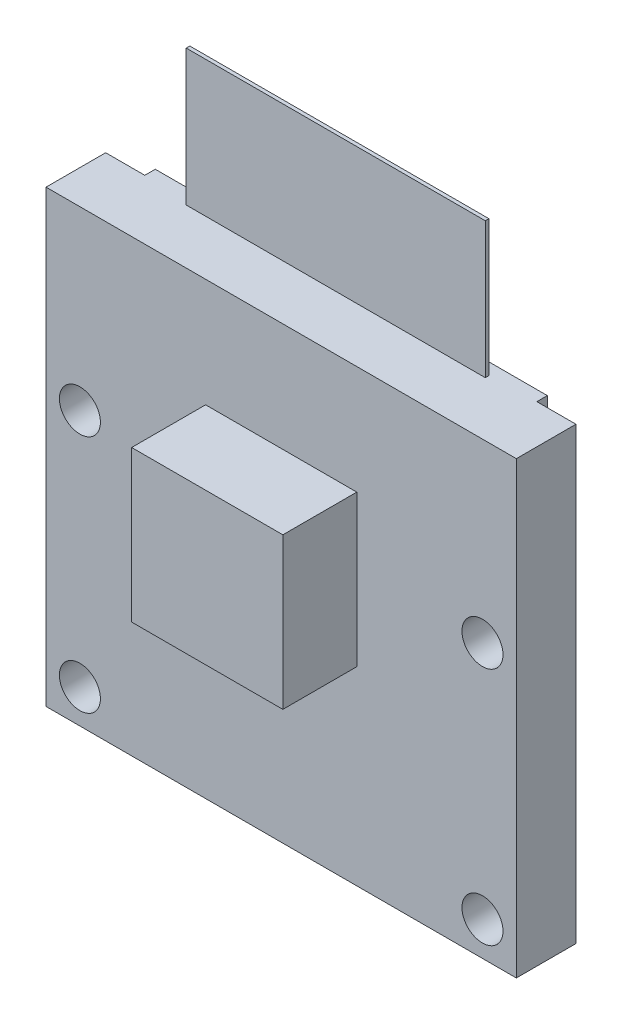
ISO-10303-21;
HEADER;
FILE_DESCRIPTION(('STEP AP214'),'2;1');
FILE_NAME('part.step','',(''),(''),'','','');
FILE_SCHEMA(('AUTOMOTIVE_DESIGN { 1 0 10303 214 1 1 1 1 }'));
ENDSEC;
DATA;
#1=APPLICATION_CONTEXT('core data for automotive mechanical design processes');
#2=APPLICATION_PROTOCOL_DEFINITION('international standard','automotive_design',2000,#1);
#3=PRODUCT_CONTEXT('',#1,'mechanical');
#4=PRODUCT('Part','Part','',(#3));
#5=PRODUCT_RELATED_PRODUCT_CATEGORY('part','',(#4));
#6=PRODUCT_DEFINITION_FORMATION('','',#4);
#7=PRODUCT_DEFINITION_CONTEXT('part definition',#1,'design');
#8=PRODUCT_DEFINITION('design','',#6,#7);
#9=PRODUCT_DEFINITION_SHAPE('','',#8);
#10=(LENGTH_UNIT() NAMED_UNIT(*) SI_UNIT(.MILLI.,.METRE.));
#11=(NAMED_UNIT(*) PLANE_ANGLE_UNIT() SI_UNIT($,.RADIAN.));
#12=(NAMED_UNIT(*) SI_UNIT($,.STERADIAN.) SOLID_ANGLE_UNIT());
#13=UNCERTAINTY_MEASURE_WITH_UNIT(LENGTH_MEASURE(1.E-05),#10,'distance_accuracy_value','');
#14=(GEOMETRIC_REPRESENTATION_CONTEXT(3) GLOBAL_UNCERTAINTY_ASSIGNED_CONTEXT((#13)) GLOBAL_UNIT_ASSIGNED_CONTEXT((#10,
#11,#12)) REPRESENTATION_CONTEXT('',''));
#15=CARTESIAN_POINT('',(0.,0.,0.));
#16=DIRECTION('',(0.,0.,1.));
#17=DIRECTION('',(1.,0.,0.));
#18=AXIS2_PLACEMENT_3D('',#15,#16,#17);
#19=CARTESIAN_POINT('',(-25.8270776775549,24.863380749288,3.175));
#20=DIRECTION('',(0.,-1.,0.));
#21=DIRECTION('',(0.,0.,-1.));
#22=AXIS2_PLACEMENT_3D('',#19,#20,#21);
#23=PLANE('',#22);
#24=DIRECTION('',(-1.,0.,0.));
#25=VECTOR('',#24,1.);
#26=CARTESIAN_POINT('',(-25.8270776775549,24.863380749288,0.));
#27=LINE('',#26,#25);
#28=CARTESIAN_POINT('',(-0.782677677554935,24.863380749288,0.));
#29=VERTEX_POINT('',#28);
#30=CARTESIAN_POINT('',(-2.86547767755493,24.863380749288,0.));
#31=VERTEX_POINT('',#30);
#32=EDGE_CURVE('E217',#29,#31,#27,.T.);
#33=ORIENTED_EDGE('',*,*,#32,.T.);
#34=DIRECTION('',(0.,0.,1.));
#35=VECTOR('',#34,1.);
#36=CARTESIAN_POINT('',(-2.86547767755493,24.863380749288,-0.5588));
#37=LINE('',#36,#35);
#38=CARTESIAN_POINT('',(-2.86547767755493,24.863380749288,-0.5588));
#39=VERTEX_POINT('',#38);
#40=EDGE_CURVE('E188',#39,#31,#37,.T.);
#41=ORIENTED_EDGE('',*,*,#40,.F.);
#42=DIRECTION('',(1.,0.,0.));
#43=VECTOR('',#42,1.);
#44=CARTESIAN_POINT('',(-2.86547767755493,24.863380749288,-0.5588));
#45=LINE('',#44,#43);
#46=CARTESIAN_POINT('',(-23.7442776775549,24.863380749288,-0.5588));
#47=VERTEX_POINT('',#46);
#48=EDGE_CURVE('E186',#47,#39,#45,.T.);
#49=ORIENTED_EDGE('',*,*,#48,.F.);
#50=DIRECTION('',(0.,0.,1.));
#51=VECTOR('',#50,1.);
#52=CARTESIAN_POINT('',(-23.7442776775549,24.863380749288,-0.5588));
#53=LINE('',#52,#51);
#54=CARTESIAN_POINT('',(-23.7442776775549,24.863380749288,0.));
#55=VERTEX_POINT('',#54);
#56=EDGE_CURVE('E200',#47,#55,#53,.T.);
#57=ORIENTED_EDGE('',*,*,#56,.T.);
#58=CARTESIAN_POINT('',(-25.8270776775549,24.863380749288,0.));
#59=VERTEX_POINT('',#58);
#60=EDGE_CURVE('E214',#55,#59,#27,.T.);
#61=ORIENTED_EDGE('',*,*,#60,.T.);
#62=DIRECTION('',(0.,0.,-1.));
#63=VECTOR('',#62,1.);
#64=CARTESIAN_POINT('',(-25.8270776775549,24.863380749288,3.175));
#65=LINE('',#64,#63);
#66=CARTESIAN_POINT('',(-25.8270776775549,24.863380749288,3.175));
#67=VERTEX_POINT('',#66);
#68=EDGE_CURVE('E223',#67,#59,#65,.T.);
#69=ORIENTED_EDGE('',*,*,#68,.F.);
#70=DIRECTION('',(-1.,0.,0.));
#71=VECTOR('',#70,1.);
#72=CARTESIAN_POINT('',(-25.8270776775549,24.863380749288,3.175));
#73=LINE('',#72,#71);
#74=CARTESIAN_POINT('',(-0.782677677554935,24.863380749288,3.175));
#75=VERTEX_POINT('',#74);
#76=EDGE_CURVE('E228',#75,#67,#73,.T.);
#77=ORIENTED_EDGE('',*,*,#76,.F.);
#78=DIRECTION('',(0.,0.,-1.));
#79=VECTOR('',#78,1.);
#80=CARTESIAN_POINT('',(-0.782677677554935,24.863380749288,3.175));
#81=LINE('',#80,#79);
#82=EDGE_CURVE('E227',#75,#29,#81,.T.);
#83=ORIENTED_EDGE('',*,*,#82,.T.);
#84=EDGE_LOOP('',(#33,#41,#49,#57,#61,#69,#77,#83));
#85=FACE_BOUND('',#84,.T.);
#86=DIRECTION('',(0.,0.,1.));
#87=VECTOR('',#86,1.);
#88=CARTESIAN_POINT('',(-21.2677776775549,24.863380749288,0.0762000000000002));
#89=LINE('',#88,#87);
#90=CARTESIAN_POINT('',(-21.2677776775549,24.863380749288,0.0762000000000002));
#91=VERTEX_POINT('',#90);
#92=CARTESIAN_POINT('',(-21.2677776775549,24.863380749288,0.268161023901502));
#93=VERTEX_POINT('',#92);
#94=EDGE_CURVE('E168',#91,#93,#89,.T.);
#95=ORIENTED_EDGE('',*,*,#94,.F.);
#96=DIRECTION('',(-1.,0.,0.));
#97=VECTOR('',#96,1.);
#98=CARTESIAN_POINT('',(-21.2677776775549,24.863380749288,0.0762000000000002));
#99=LINE('',#98,#97);
#100=CARTESIAN_POINT('',(-5.34197767755493,24.863380749288,0.0761999999999982));
#101=VERTEX_POINT('',#100);
#102=EDGE_CURVE('E165',#101,#91,#99,.T.);
#103=ORIENTED_EDGE('',*,*,#102,.F.);
#104=DIRECTION('',(0.,0.,-1.));
#105=VECTOR('',#104,1.);
#106=CARTESIAN_POINT('',(-5.34197767755493,24.863380749288,0.0761999999999983));
#107=LINE('',#106,#105);
#108=CARTESIAN_POINT('',(-5.34197767755493,24.863380749288,0.2681610239015));
#109=VERTEX_POINT('',#108);
#110=EDGE_CURVE('E55',#109,#101,#107,.T.);
#111=ORIENTED_EDGE('',*,*,#110,.F.);
#112=DIRECTION('',(1.,0.,0.));
#113=VECTOR('',#112,1.);
#114=CARTESIAN_POINT('',(-21.2677776775549,24.863380749288,0.268161023901502));
#115=LINE('',#114,#113);
#116=EDGE_CURVE('E50',#93,#109,#115,.T.);
#117=ORIENTED_EDGE('',*,*,#116,.F.);
#118=EDGE_LOOP('',(#95,#103,#111,#117));
#119=FACE_BOUND('',#118,.T.);
#120=ADVANCED_FACE('F33',(#85,#119),#23,.F.);
#121=CARTESIAN_POINT('',(0.,0.,3.175));
#122=DIRECTION('',(0.,0.,-1.));
#123=DIRECTION('',(-1.,0.,0.));
#124=AXIS2_PLACEMENT_3D('',#121,#122,#123);
#125=PLANE('',#124);
#126=DIRECTION('',(0.,-1.,0.));
#127=VECTOR('',#126,1.);
#128=CARTESIAN_POINT('',(-25.8270776775549,0.911180749287973,3.175));
#129=LINE('',#128,#127);
#130=CARTESIAN_POINT('',(-25.8270776775549,0.911180749287973,3.175));
#131=VERTEX_POINT('',#130);
#132=EDGE_CURVE('E256',#67,#131,#129,.T.);
#133=ORIENTED_EDGE('',*,*,#132,.T.);
#134=DIRECTION('',(1.,0.,0.));
#135=VECTOR('',#134,1.);
#136=CARTESIAN_POINT('',(-25.8270776775549,0.911180749287973,3.175));
#137=LINE('',#136,#135);
#138=CARTESIAN_POINT('',(-0.782677677554935,0.911180749287973,3.175));
#139=VERTEX_POINT('',#138);
#140=EDGE_CURVE('E254',#131,#139,#137,.T.);
#141=ORIENTED_EDGE('',*,*,#140,.T.);
#142=DIRECTION('',(0.,1.,0.));
#143=VECTOR('',#142,1.);
#144=CARTESIAN_POINT('',(-0.782677677554935,0.911180749287973,3.175));
#145=LINE('',#144,#143);
#146=EDGE_CURVE('E238',#139,#75,#145,.T.);
#147=ORIENTED_EDGE('',*,*,#146,.T.);
#148=ORIENTED_EDGE('',*,*,#76,.T.);
#149=EDGE_LOOP('',(#133,#141,#147,#148));
#150=FACE_BOUND('',#149,.T.);
#151=CARTESIAN_POINT('',(-2.58607767755493,2.71458074928797,3.175));
#152=DIRECTION('',(0.,0.,1.));
#153=DIRECTION('',(1.,0.,0.));
#154=AXIS2_PLACEMENT_3D('',#151,#152,#153);
#155=CIRCLE('',#154,1.0922);
#156=CARTESIAN_POINT('',(-1.49387767755493,2.71458074928797,3.175));
#157=VERTEX_POINT('',#156);
#158=EDGE_CURVE('E259',#157,#157,#155,.T.);
#159=ORIENTED_EDGE('',*,*,#158,.F.);
#160=EDGE_LOOP('',(#159));
#161=FACE_BOUND('',#160,.T.);
#162=CARTESIAN_POINT('',(-2.58607767755493,15.465380749288,3.175));
#163=DIRECTION('',(0.,0.,1.));
#164=DIRECTION('',(1.,0.,0.));
#165=AXIS2_PLACEMENT_3D('',#162,#163,#164);
#166=CIRCLE('',#165,1.0922);
#167=CARTESIAN_POINT('',(-1.49387767755493,15.465380749288,3.175));
#168=VERTEX_POINT('',#167);
#169=EDGE_CURVE('E265',#168,#168,#166,.T.);
#170=ORIENTED_EDGE('',*,*,#169,.F.);
#171=EDGE_LOOP('',(#170));
#172=FACE_BOUND('',#171,.T.);
#173=CARTESIAN_POINT('',(-24.0236776775549,2.71458074928797,3.175));
#174=DIRECTION('',(0.,0.,1.));
#175=DIRECTION('',(-1.,0.,0.));
#176=AXIS2_PLACEMENT_3D('',#173,#174,#175);
#177=CIRCLE('',#176,1.0922);
#178=CARTESIAN_POINT('',(-25.1158776775549,2.71458074928797,3.175));
#179=VERTEX_POINT('',#178);
#180=EDGE_CURVE('E271',#179,#179,#177,.T.);
#181=ORIENTED_EDGE('',*,*,#180,.F.);
#182=EDGE_LOOP('',(#181));
#183=FACE_BOUND('',#182,.T.);
#184=CARTESIAN_POINT('',(-24.0236776775549,15.465380749288,3.175));
#185=DIRECTION('',(0.,0.,1.));
#186=DIRECTION('',(-1.,0.,0.));
#187=AXIS2_PLACEMENT_3D('',#184,#185,#186);
#188=CIRCLE('',#187,1.0922);
#189=CARTESIAN_POINT('',(-25.1158776775549,15.465380749288,3.175));
#190=VERTEX_POINT('',#189);
#191=EDGE_CURVE('E277',#190,#190,#188,.T.);
#192=ORIENTED_EDGE('',*,*,#191,.F.);
#193=EDGE_LOOP('',(#192));
#194=FACE_BOUND('',#193,.T.);
#195=DIRECTION('',(0.,-1.,0.));
#196=VECTOR('',#195,1.);
#197=CARTESIAN_POINT('',(-17.3307776775549,19.072180749288,3.175));
#198=LINE('',#197,#196);
#199=CARTESIAN_POINT('',(-17.3307776775549,19.072180749288,3.175));
#200=VERTEX_POINT('',#199);
#201=CARTESIAN_POINT('',(-17.3307776775549,11.020380749288,3.175));
#202=VERTEX_POINT('',#201);
#203=EDGE_CURVE('E305',#200,#202,#198,.T.);
#204=ORIENTED_EDGE('',*,*,#203,.F.);
#205=DIRECTION('',(-1.,0.,0.));
#206=VECTOR('',#205,1.);
#207=CARTESIAN_POINT('',(-17.3307776775549,19.072180749288,3.175));
#208=LINE('',#207,#206);
#209=CARTESIAN_POINT('',(-9.27897767755493,19.072180749288,3.175));
#210=VERTEX_POINT('',#209);
#211=EDGE_CURVE('E295',#210,#200,#208,.T.);
#212=ORIENTED_EDGE('',*,*,#211,.F.);
#213=DIRECTION('',(0.,1.,0.));
#214=VECTOR('',#213,1.);
#215=CARTESIAN_POINT('',(-9.27897767755493,19.072180749288,3.175));
#216=LINE('',#215,#214);
#217=CARTESIAN_POINT('',(-9.27897767755493,11.020380749288,3.175));
#218=VERTEX_POINT('',#217);
#219=EDGE_CURVE('E299',#218,#210,#216,.T.);
#220=ORIENTED_EDGE('',*,*,#219,.F.);
#221=DIRECTION('',(1.,0.,0.));
#222=VECTOR('',#221,1.);
#223=CARTESIAN_POINT('',(-17.3307776775549,11.020380749288,3.175));
#224=LINE('',#223,#222);
#225=EDGE_CURVE('E302',#202,#218,#224,.T.);
#226=ORIENTED_EDGE('',*,*,#225,.F.);
#227=EDGE_LOOP('',(#204,#212,#220,#226));
#228=FACE_BOUND('',#227,.T.);
#229=ADVANCED_FACE('F324',(#150,#161,#172,#183,#194,#228),#125,.F.);
#230=CARTESIAN_POINT('',(-25.8270776775549,0.911180749287973,3.175));
#231=DIRECTION('',(1.,0.,0.));
#232=DIRECTION('',(0.,0.,-1.));
#233=AXIS2_PLACEMENT_3D('',#230,#231,#232);
#234=PLANE('',#233);
#235=DIRECTION('',(0.,-1.,0.));
#236=VECTOR('',#235,1.);
#237=CARTESIAN_POINT('',(-25.8270776775549,0.911180749287973,0.));
#238=LINE('',#237,#236);
#239=CARTESIAN_POINT('',(-25.8270776775549,0.911180749287973,0.));
#240=VERTEX_POINT('',#239);
#241=EDGE_CURVE('E247',#59,#240,#238,.T.);
#242=ORIENTED_EDGE('',*,*,#241,.T.);
#243=DIRECTION('',(0.,0.,-1.));
#244=VECTOR('',#243,1.);
#245=CARTESIAN_POINT('',(-25.8270776775549,0.911180749287973,3.175));
#246=LINE('',#245,#244);
#247=EDGE_CURVE('E11',#131,#240,#246,.T.);
#248=ORIENTED_EDGE('',*,*,#247,.F.);
#249=ORIENTED_EDGE('',*,*,#132,.F.);
#250=ORIENTED_EDGE('',*,*,#68,.T.);
#251=EDGE_LOOP('',(#242,#248,#249,#250));
#252=FACE_BOUND('',#251,.T.);
#253=ADVANCED_FACE('F35',(#252),#234,.F.);
#254=CARTESIAN_POINT('',(-25.8270776775549,0.911180749287973,3.175));
#255=DIRECTION('',(0.,1.,0.));
#256=DIRECTION('',(0.,0.,1.));
#257=AXIS2_PLACEMENT_3D('',#254,#255,#256);
#258=PLANE('',#257);
#259=DIRECTION('',(1.,0.,0.));
#260=VECTOR('',#259,1.);
#261=CARTESIAN_POINT('',(-25.8270776775549,0.911180749287973,0.));
#262=LINE('',#261,#260);
#263=CARTESIAN_POINT('',(-0.782677677554935,0.911180749287973,0.));
#264=VERTEX_POINT('',#263);
#265=EDGE_CURVE('E245',#240,#264,#262,.T.);
#266=ORIENTED_EDGE('',*,*,#265,.T.);
#267=DIRECTION('',(0.,0.,-1.));
#268=VECTOR('',#267,1.);
#269=CARTESIAN_POINT('',(-0.782677677554935,0.911180749287973,3.175));
#270=LINE('',#269,#268);
#271=EDGE_CURVE('E42',#139,#264,#270,.T.);
#272=ORIENTED_EDGE('',*,*,#271,.F.);
#273=ORIENTED_EDGE('',*,*,#140,.F.);
#274=ORIENTED_EDGE('',*,*,#247,.T.);
#275=EDGE_LOOP('',(#266,#272,#273,#274));
#276=FACE_BOUND('',#275,.T.);
#277=ADVANCED_FACE('F327',(#276),#258,.F.);
#278=CARTESIAN_POINT('',(-0.782677677554935,0.911180749287973,3.175));
#279=DIRECTION('',(-1.,0.,0.));
#280=DIRECTION('',(0.,0.,1.));
#281=AXIS2_PLACEMENT_3D('',#278,#279,#280);
#282=PLANE('',#281);
#283=DIRECTION('',(0.,1.,0.));
#284=VECTOR('',#283,1.);
#285=CARTESIAN_POINT('',(-0.782677677554935,0.911180749287973,0.));
#286=LINE('',#285,#284);
#287=EDGE_CURVE('E218',#264,#29,#286,.T.);
#288=ORIENTED_EDGE('',*,*,#287,.T.);
#289=ORIENTED_EDGE('',*,*,#82,.F.);
#290=ORIENTED_EDGE('',*,*,#146,.F.);
#291=ORIENTED_EDGE('',*,*,#271,.T.);
#292=EDGE_LOOP('',(#288,#289,#290,#291));
#293=FACE_BOUND('',#292,.T.);
#294=ADVANCED_FACE('F236',(#293),#282,.F.);
#295=CARTESIAN_POINT('',(0.,0.,0.));
#296=DIRECTION('',(0.,0.,-1.));
#297=DIRECTION('',(-1.,0.,0.));
#298=AXIS2_PLACEMENT_3D('',#295,#296,#297);
#299=PLANE('',#298);
#300=DIRECTION('',(0.,-1.,0.));
#301=VECTOR('',#300,1.);
#302=CARTESIAN_POINT('',(-2.86547767755493,24.863380749288,0.));
#303=LINE('',#302,#301);
#304=CARTESIAN_POINT('',(-2.86547767755493,19.326180749288,0.));
#305=VERTEX_POINT('',#304);
#306=EDGE_CURVE('E169',#31,#305,#303,.T.);
#307=ORIENTED_EDGE('',*,*,#306,.F.);
#308=ORIENTED_EDGE('',*,*,#32,.F.);
#309=ORIENTED_EDGE('',*,*,#287,.F.);
#310=ORIENTED_EDGE('',*,*,#265,.F.);
#311=ORIENTED_EDGE('',*,*,#241,.F.);
#312=ORIENTED_EDGE('',*,*,#60,.F.);
#313=DIRECTION('',(0.,1.,0.));
#314=VECTOR('',#313,1.);
#315=CARTESIAN_POINT('',(-23.7442776775549,24.863380749288,0.));
#316=LINE('',#315,#314);
#317=CARTESIAN_POINT('',(-23.7442776775549,19.326180749288,0.));
#318=VERTEX_POINT('',#317);
#319=EDGE_CURVE('E182',#318,#55,#316,.T.);
#320=ORIENTED_EDGE('',*,*,#319,.F.);
#321=DIRECTION('',(-1.,0.,0.));
#322=VECTOR('',#321,1.);
#323=CARTESIAN_POINT('',(-2.86547767755493,19.326180749288,0.));
#324=LINE('',#323,#322);
#325=EDGE_CURVE('E172',#305,#318,#324,.T.);
#326=ORIENTED_EDGE('',*,*,#325,.F.);
#327=EDGE_LOOP('',(#307,#308,#309,#310,#311,#312,#320,#326));
#328=FACE_BOUND('',#327,.T.);
#329=CARTESIAN_POINT('',(-24.0236776775549,15.465380749288,0.));
#330=DIRECTION('',(0.,0.,1.));
#331=DIRECTION('',(-1.,0.,0.));
#332=AXIS2_PLACEMENT_3D('',#329,#330,#331);
#333=CIRCLE('',#332,1.0922);
#334=CARTESIAN_POINT('',(-25.1158776775549,15.465380749288,0.));
#335=VERTEX_POINT('',#334);
#336=EDGE_CURVE('E274',#335,#335,#333,.T.);
#337=ORIENTED_EDGE('',*,*,#336,.T.);
#338=EDGE_LOOP('',(#337));
#339=FACE_BOUND('',#338,.T.);
#340=CARTESIAN_POINT('',(-24.0236776775549,2.71458074928797,0.));
#341=DIRECTION('',(0.,0.,1.));
#342=DIRECTION('',(-1.,0.,0.));
#343=AXIS2_PLACEMENT_3D('',#340,#341,#342);
#344=CIRCLE('',#343,1.0922);
#345=CARTESIAN_POINT('',(-25.1158776775549,2.71458074928797,0.));
#346=VERTEX_POINT('',#345);
#347=EDGE_CURVE('E268',#346,#346,#344,.T.);
#348=ORIENTED_EDGE('',*,*,#347,.T.);
#349=EDGE_LOOP('',(#348));
#350=FACE_BOUND('',#349,.T.);
#351=CARTESIAN_POINT('',(-2.58607767755493,15.465380749288,0.));
#352=DIRECTION('',(0.,0.,1.));
#353=DIRECTION('',(1.,0.,0.));
#354=AXIS2_PLACEMENT_3D('',#351,#352,#353);
#355=CIRCLE('',#354,1.0922);
#356=CARTESIAN_POINT('',(-1.49387767755493,15.465380749288,0.));
#357=VERTEX_POINT('',#356);
#358=EDGE_CURVE('E262',#357,#357,#355,.T.);
#359=ORIENTED_EDGE('',*,*,#358,.T.);
#360=EDGE_LOOP('',(#359));
#361=FACE_BOUND('',#360,.T.);
#362=CARTESIAN_POINT('',(-2.58607767755493,2.71458074928797,0.));
#363=DIRECTION('',(0.,0.,1.));
#364=DIRECTION('',(1.,0.,0.));
#365=AXIS2_PLACEMENT_3D('',#362,#363,#364);
#366=CIRCLE('',#365,1.0922);
#367=CARTESIAN_POINT('',(-1.49387767755493,2.71458074928797,0.));
#368=VERTEX_POINT('',#367);
#369=EDGE_CURVE('E249',#368,#368,#366,.T.);
#370=ORIENTED_EDGE('',*,*,#369,.T.);
#371=EDGE_LOOP('',(#370));
#372=FACE_BOUND('',#371,.T.);
#373=ADVANCED_FACE('F242',(#328,#339,#350,#361,#372),#299,.T.);
#374=CARTESIAN_POINT('',(-2.58607767755493,2.71458074928797,0.));
#375=DIRECTION('',(0.,0.,1.));
#376=DIRECTION('',(1.,0.,0.));
#377=AXIS2_PLACEMENT_3D('',#374,#375,#376);
#378=CYLINDRICAL_SURFACE('',#377,1.0922);
#379=ORIENTED_EDGE('',*,*,#369,.F.);
#380=EDGE_LOOP('',(#379));
#381=FACE_BOUND('',#380,.T.);
#382=ORIENTED_EDGE('',*,*,#158,.T.);
#383=EDGE_LOOP('',(#382));
#384=FACE_BOUND('',#383,.T.);
#385=ADVANCED_FACE('F428',(#381,#384),#378,.F.);
#386=CARTESIAN_POINT('',(-2.58607767755493,15.465380749288,0.));
#387=DIRECTION('',(0.,0.,1.));
#388=DIRECTION('',(1.,0.,0.));
#389=AXIS2_PLACEMENT_3D('',#386,#387,#388);
#390=CYLINDRICAL_SURFACE('',#389,1.0922);
#391=ORIENTED_EDGE('',*,*,#358,.F.);
#392=EDGE_LOOP('',(#391));
#393=FACE_BOUND('',#392,.T.);
#394=ORIENTED_EDGE('',*,*,#169,.T.);
#395=EDGE_LOOP('',(#394));
#396=FACE_BOUND('',#395,.T.);
#397=ADVANCED_FACE('F524',(#393,#396),#390,.F.);
#398=CARTESIAN_POINT('',(-24.0236776775549,2.71458074928797,0.));
#399=DIRECTION('',(0.,0.,1.));
#400=DIRECTION('',(1.,0.,0.));
#401=AXIS2_PLACEMENT_3D('',#398,#399,#400);
#402=CYLINDRICAL_SURFACE('',#401,1.0922);
#403=ORIENTED_EDGE('',*,*,#347,.F.);
#404=EDGE_LOOP('',(#403));
#405=FACE_BOUND('',#404,.T.);
#406=ORIENTED_EDGE('',*,*,#180,.T.);
#407=EDGE_LOOP('',(#406));
#408=FACE_BOUND('',#407,.T.);
#409=ADVANCED_FACE('F520',(#405,#408),#402,.F.);
#410=CARTESIAN_POINT('',(-24.0236776775549,15.465380749288,0.));
#411=DIRECTION('',(0.,0.,1.));
#412=DIRECTION('',(1.,0.,0.));
#413=AXIS2_PLACEMENT_3D('',#410,#411,#412);
#414=CYLINDRICAL_SURFACE('',#413,1.0922);
#415=ORIENTED_EDGE('',*,*,#336,.F.);
#416=EDGE_LOOP('',(#415));
#417=FACE_BOUND('',#416,.T.);
#418=ORIENTED_EDGE('',*,*,#191,.T.);
#419=EDGE_LOOP('',(#418));
#420=FACE_BOUND('',#419,.T.);
#421=ADVANCED_FACE('F369',(#417,#420),#414,.F.);
#422=CARTESIAN_POINT('',(-17.3307776775549,19.072180749288,7.112));
#423=DIRECTION('',(1.,0.,0.));
#424=DIRECTION('',(0.,0.,-1.));
#425=AXIS2_PLACEMENT_3D('',#422,#423,#424);
#426=PLANE('',#425);
#427=ORIENTED_EDGE('',*,*,#203,.T.);
#428=DIRECTION('',(0.,0.,-1.));
#429=VECTOR('',#428,1.);
#430=CARTESIAN_POINT('',(-17.3307776775549,11.020380749288,7.112));
#431=LINE('',#430,#429);
#432=CARTESIAN_POINT('',(-17.3307776775549,11.020380749288,7.112));
#433=VERTEX_POINT('',#432);
#434=EDGE_CURVE('E280',#433,#202,#431,.T.);
#435=ORIENTED_EDGE('',*,*,#434,.F.);
#436=DIRECTION('',(0.,-1.,0.));
#437=VECTOR('',#436,1.);
#438=CARTESIAN_POINT('',(-17.3307776775549,19.072180749288,7.112));
#439=LINE('',#438,#437);
#440=CARTESIAN_POINT('',(-17.3307776775549,19.072180749288,7.112));
#441=VERTEX_POINT('',#440);
#442=EDGE_CURVE('E298',#441,#433,#439,.T.);
#443=ORIENTED_EDGE('',*,*,#442,.F.);
#444=DIRECTION('',(0.,0.,-1.));
#445=VECTOR('',#444,1.);
#446=CARTESIAN_POINT('',(-17.3307776775549,19.072180749288,7.112));
#447=LINE('',#446,#445);
#448=EDGE_CURVE('E291',#441,#200,#447,.T.);
#449=ORIENTED_EDGE('',*,*,#448,.T.);
#450=EDGE_LOOP('',(#427,#435,#443,#449));
#451=FACE_BOUND('',#450,.T.);
#452=ADVANCED_FACE('F373',(#451),#426,.F.);
#453=CARTESIAN_POINT('',(-17.3307776775549,11.020380749288,7.112));
#454=DIRECTION('',(0.,1.,0.));
#455=DIRECTION('',(-1.,0.,0.));
#456=AXIS2_PLACEMENT_3D('',#453,#454,#455);
#457=PLANE('',#456);
#458=ORIENTED_EDGE('',*,*,#225,.T.);
#459=DIRECTION('',(0.,0.,-1.));
#460=VECTOR('',#459,1.);
#461=CARTESIAN_POINT('',(-9.27897767755493,11.020380749288,7.112));
#462=LINE('',#461,#460);
#463=CARTESIAN_POINT('',(-9.27897767755493,11.020380749288,7.112));
#464=VERTEX_POINT('',#463);
#465=EDGE_CURVE('E285',#464,#218,#462,.T.);
#466=ORIENTED_EDGE('',*,*,#465,.F.);
#467=DIRECTION('',(1.,0.,0.));
#468=VECTOR('',#467,1.);
#469=CARTESIAN_POINT('',(-17.3307776775549,11.020380749288,7.112));
#470=LINE('',#469,#468);
#471=EDGE_CURVE('E311',#433,#464,#470,.T.);
#472=ORIENTED_EDGE('',*,*,#471,.F.);
#473=ORIENTED_EDGE('',*,*,#434,.T.);
#474=EDGE_LOOP('',(#458,#466,#472,#473));
#475=FACE_BOUND('',#474,.T.);
#476=ADVANCED_FACE('F377',(#475),#457,.F.);
#477=CARTESIAN_POINT('',(-9.27897767755493,19.072180749288,7.112));
#478=DIRECTION('',(-1.,0.,0.));
#479=DIRECTION('',(0.,-1.,0.));
#480=AXIS2_PLACEMENT_3D('',#477,#478,#479);
#481=PLANE('',#480);
#482=ORIENTED_EDGE('',*,*,#219,.T.);
#483=DIRECTION('',(0.,0.,-1.));
#484=VECTOR('',#483,1.);
#485=CARTESIAN_POINT('',(-9.27897767755493,19.072180749288,7.112));
#486=LINE('',#485,#484);
#487=CARTESIAN_POINT('',(-9.27897767755493,19.072180749288,7.112));
#488=VERTEX_POINT('',#487);
#489=EDGE_CURVE('E288',#488,#210,#486,.T.);
#490=ORIENTED_EDGE('',*,*,#489,.F.);
#491=DIRECTION('',(0.,1.,0.));
#492=VECTOR('',#491,1.);
#493=CARTESIAN_POINT('',(-9.27897767755493,19.072180749288,7.112));
#494=LINE('',#493,#492);
#495=EDGE_CURVE('E309',#464,#488,#494,.T.);
#496=ORIENTED_EDGE('',*,*,#495,.F.);
#497=ORIENTED_EDGE('',*,*,#465,.T.);
#498=EDGE_LOOP('',(#482,#490,#496,#497));
#499=FACE_BOUND('',#498,.T.);
#500=ADVANCED_FACE('F387',(#499),#481,.F.);
#501=CARTESIAN_POINT('',(-17.3307776775549,19.072180749288,7.112));
#502=DIRECTION('',(0.,-1.,0.));
#503=DIRECTION('',(0.,0.,-1.));
#504=AXIS2_PLACEMENT_3D('',#501,#502,#503);
#505=PLANE('',#504);
#506=ORIENTED_EDGE('',*,*,#211,.T.);
#507=ORIENTED_EDGE('',*,*,#448,.F.);
#508=DIRECTION('',(-1.,0.,0.));
#509=VECTOR('',#508,1.);
#510=CARTESIAN_POINT('',(-17.3307776775549,19.072180749288,7.112));
#511=LINE('',#510,#509);
#512=EDGE_CURVE('E294',#488,#441,#511,.T.);
#513=ORIENTED_EDGE('',*,*,#512,.F.);
#514=ORIENTED_EDGE('',*,*,#489,.T.);
#515=EDGE_LOOP('',(#506,#507,#513,#514));
#516=FACE_BOUND('',#515,.T.);
#517=ADVANCED_FACE('F397',(#516),#505,.F.);
#518=CARTESIAN_POINT('',(0.,0.,7.112));
#519=DIRECTION('',(0.,0.,1.));
#520=DIRECTION('',(1.,0.,0.));
#521=AXIS2_PLACEMENT_3D('',#518,#519,#520);
#522=PLANE('',#521);
#523=ORIENTED_EDGE('',*,*,#442,.T.);
#524=ORIENTED_EDGE('',*,*,#471,.T.);
#525=ORIENTED_EDGE('',*,*,#495,.T.);
#526=ORIENTED_EDGE('',*,*,#512,.T.);
#527=EDGE_LOOP('',(#523,#524,#525,#526));
#528=FACE_BOUND('',#527,.T.);
#529=ADVANCED_FACE('F407',(#528),#522,.T.);
#530=CARTESIAN_POINT('',(-2.86547767755493,24.863380749288,-0.5588));
#531=DIRECTION('',(-1.,0.,0.));
#532=DIRECTION('',(0.,-1.,0.));
#533=AXIS2_PLACEMENT_3D('',#530,#531,#532);
#534=PLANE('',#533);
#535=ORIENTED_EDGE('',*,*,#306,.T.);
#536=DIRECTION('',(0.,0.,1.));
#537=VECTOR('',#536,1.);
#538=CARTESIAN_POINT('',(-2.86547767755493,19.326180749288,-0.5588));
#539=LINE('',#538,#537);
#540=CARTESIAN_POINT('',(-2.86547767755493,19.326180749288,-0.5588));
#541=VERTEX_POINT('',#540);
#542=EDGE_CURVE('E206',#541,#305,#539,.T.);
#543=ORIENTED_EDGE('',*,*,#542,.F.);
#544=DIRECTION('',(0.,-1.,0.));
#545=VECTOR('',#544,1.);
#546=CARTESIAN_POINT('',(-2.86547767755493,24.863380749288,-0.5588));
#547=LINE('',#546,#545);
#548=EDGE_CURVE('E178',#39,#541,#547,.T.);
#549=ORIENTED_EDGE('',*,*,#548,.F.);
#550=ORIENTED_EDGE('',*,*,#40,.T.);
#551=EDGE_LOOP('',(#535,#543,#549,#550));
#552=FACE_BOUND('',#551,.T.);
#553=ADVANCED_FACE('F319',(#552),#534,.F.);
#554=CARTESIAN_POINT('',(-2.86547767755493,19.326180749288,-0.5588));
#555=DIRECTION('',(0.,1.,0.));
#556=DIRECTION('',(-1.,0.,0.));
#557=AXIS2_PLACEMENT_3D('',#554,#555,#556);
#558=PLANE('',#557);
#559=ORIENTED_EDGE('',*,*,#325,.T.);
#560=DIRECTION('',(0.,0.,1.));
#561=VECTOR('',#560,1.);
#562=CARTESIAN_POINT('',(-23.7442776775549,19.326180749288,-0.5588));
#563=LINE('',#562,#561);
#564=CARTESIAN_POINT('',(-23.7442776775549,19.326180749288,-0.5588));
#565=VERTEX_POINT('',#564);
#566=EDGE_CURVE('E193',#565,#318,#563,.T.);
#567=ORIENTED_EDGE('',*,*,#566,.F.);
#568=DIRECTION('',(-1.,0.,0.));
#569=VECTOR('',#568,1.);
#570=CARTESIAN_POINT('',(-2.86547767755493,19.326180749288,-0.5588));
#571=LINE('',#570,#569);
#572=EDGE_CURVE('E181',#541,#565,#571,.T.);
#573=ORIENTED_EDGE('',*,*,#572,.F.);
#574=ORIENTED_EDGE('',*,*,#542,.T.);
#575=EDGE_LOOP('',(#559,#567,#573,#574));
#576=FACE_BOUND('',#575,.T.);
#577=ADVANCED_FACE('F317',(#576),#558,.F.);
#578=CARTESIAN_POINT('',(-23.7442776775549,24.863380749288,-0.5588));
#579=DIRECTION('',(1.,0.,0.));
#580=DIRECTION('',(0.,1.,0.));
#581=AXIS2_PLACEMENT_3D('',#578,#579,#580);
#582=PLANE('',#581);
#583=ORIENTED_EDGE('',*,*,#319,.T.);
#584=ORIENTED_EDGE('',*,*,#56,.F.);
#585=DIRECTION('',(0.,1.,0.));
#586=VECTOR('',#585,1.);
#587=CARTESIAN_POINT('',(-23.7442776775549,24.863380749288,-0.5588));
#588=LINE('',#587,#586);
#589=EDGE_CURVE('E184',#565,#47,#588,.T.);
#590=ORIENTED_EDGE('',*,*,#589,.F.);
#591=ORIENTED_EDGE('',*,*,#566,.T.);
#592=EDGE_LOOP('',(#583,#584,#590,#591));
#593=FACE_BOUND('',#592,.T.);
#594=ADVANCED_FACE('F330',(#593),#582,.F.);
#595=CARTESIAN_POINT('',(0.,0.,-0.5588));
#596=DIRECTION('',(0.,0.,-1.));
#597=DIRECTION('',(-1.,0.,0.));
#598=AXIS2_PLACEMENT_3D('',#595,#596,#597);
#599=PLANE('',#598);
#600=ORIENTED_EDGE('',*,*,#548,.T.);
#601=ORIENTED_EDGE('',*,*,#572,.T.);
#602=ORIENTED_EDGE('',*,*,#589,.T.);
#603=ORIENTED_EDGE('',*,*,#48,.T.);
#604=EDGE_LOOP('',(#600,#601,#602,#603));
#605=FACE_BOUND('',#604,.T.);
#606=ADVANCED_FACE('F333',(#605),#599,.T.);
#607=CARTESIAN_POINT('',(-21.2677776775549,32.102380749288,0.0762000000000002));
#608=DIRECTION('',(1.,0.,0.));
#609=DIRECTION('',(0.,0.,-1.));
#610=AXIS2_PLACEMENT_3D('',#607,#608,#609);
#611=PLANE('',#610);
#612=ORIENTED_EDGE('',*,*,#94,.T.);
#613=DIRECTION('',(0.,-1.,0.));
#614=VECTOR('',#613,1.);
#615=CARTESIAN_POINT('',(-21.2677776775549,32.102380749288,0.268161023901502));
#616=LINE('',#615,#614);
#617=CARTESIAN_POINT('',(-21.2677776775549,32.102380749288,0.268161023901502));
#618=VERTEX_POINT('',#617);
#619=EDGE_CURVE('E149',#618,#93,#616,.T.);
#620=ORIENTED_EDGE('',*,*,#619,.F.);
#621=DIRECTION('',(0.,0.,1.));
#622=VECTOR('',#621,1.);
#623=CARTESIAN_POINT('',(-21.2677776775549,32.102380749288,0.0762000000000002));
#624=LINE('',#623,#622);
#625=CARTESIAN_POINT('',(-21.2677776775549,32.102380749288,0.0762000000000002));
#626=VERTEX_POINT('',#625);
#627=EDGE_CURVE('E156',#626,#618,#624,.T.);
#628=ORIENTED_EDGE('',*,*,#627,.F.);
#629=DIRECTION('',(0.,-1.,0.));
#630=VECTOR('',#629,1.);
#631=CARTESIAN_POINT('',(-21.2677776775549,32.102380749288,0.0762000000000002));
#632=LINE('',#631,#630);
#633=EDGE_CURVE('E507',#626,#91,#632,.T.);
#634=ORIENTED_EDGE('',*,*,#633,.T.);
#635=EDGE_LOOP('',(#612,#620,#628,#634));
#636=FACE_BOUND('',#635,.T.);
#637=ADVANCED_FACE('F167',(#636),#611,.F.);
#638=CARTESIAN_POINT('',(-21.2677776775549,32.102380749288,0.268161023901502));
#639=DIRECTION('',(0.,0.,-1.));
#640=DIRECTION('',(-1.,0.,0.));
#641=AXIS2_PLACEMENT_3D('',#638,#639,#640);
#642=PLANE('',#641);
#643=ORIENTED_EDGE('',*,*,#116,.T.);
#644=DIRECTION('',(0.,-1.,0.));
#645=VECTOR('',#644,1.);
#646=CARTESIAN_POINT('',(-5.34197767755493,32.102380749288,0.268161023901501));
#647=LINE('',#646,#645);
#648=CARTESIAN_POINT('',(-5.34197767755493,32.102380749288,0.268161023901501));
#649=VERTEX_POINT('',#648);
#650=EDGE_CURVE('E152',#649,#109,#647,.T.);
#651=ORIENTED_EDGE('',*,*,#650,.F.);
#652=DIRECTION('',(1.,0.,0.));
#653=VECTOR('',#652,1.);
#654=CARTESIAN_POINT('',(-21.2677776775549,32.102380749288,0.268161023901502));
#655=LINE('',#654,#653);
#656=EDGE_CURVE('E145',#618,#649,#655,.T.);
#657=ORIENTED_EDGE('',*,*,#656,.F.);
#658=ORIENTED_EDGE('',*,*,#619,.T.);
#659=EDGE_LOOP('',(#643,#651,#657,#658));
#660=FACE_BOUND('',#659,.T.);
#661=ADVANCED_FACE('F147',(#660),#642,.F.);
#662=CARTESIAN_POINT('',(-5.34197767755493,32.102380749288,0.0761999999999983));
#663=DIRECTION('',(-1.,0.,0.));
#664=DIRECTION('',(0.,0.,1.));
#665=AXIS2_PLACEMENT_3D('',#662,#663,#664);
#666=PLANE('',#665);
#667=ORIENTED_EDGE('',*,*,#110,.T.);
#668=DIRECTION('',(0.,-1.,0.));
#669=VECTOR('',#668,1.);
#670=CARTESIAN_POINT('',(-5.34197767755493,32.102380749288,0.0761999999999983));
#671=LINE('',#670,#669);
#672=CARTESIAN_POINT('',(-5.34197767755493,32.102380749288,0.0761999999999983));
#673=VERTEX_POINT('',#672);
#674=EDGE_CURVE('E174',#673,#101,#671,.T.);
#675=ORIENTED_EDGE('',*,*,#674,.F.);
#676=DIRECTION('',(0.,0.,-1.));
#677=VECTOR('',#676,1.);
#678=CARTESIAN_POINT('',(-5.34197767755493,32.102380749288,0.0761999999999983));
#679=LINE('',#678,#677);
#680=EDGE_CURVE('E155',#649,#673,#679,.T.);
#681=ORIENTED_EDGE('',*,*,#680,.F.);
#682=ORIENTED_EDGE('',*,*,#650,.T.);
#683=EDGE_LOOP('',(#667,#675,#681,#682));
#684=FACE_BOUND('',#683,.T.);
#685=ADVANCED_FACE('F474',(#684),#666,.F.);
#686=CARTESIAN_POINT('',(-21.2677776775549,32.102380749288,0.0762000000000002));
#687=DIRECTION('',(0.,0.,1.));
#688=DIRECTION('',(1.,0.,0.));
#689=AXIS2_PLACEMENT_3D('',#686,#687,#688);
#690=PLANE('',#689);
#691=ORIENTED_EDGE('',*,*,#102,.T.);
#692=ORIENTED_EDGE('',*,*,#633,.F.);
#693=DIRECTION('',(-1.,0.,0.));
#694=VECTOR('',#693,1.);
#695=CARTESIAN_POINT('',(-21.2677776775549,32.102380749288,0.0762000000000002));
#696=LINE('',#695,#694);
#697=EDGE_CURVE('E161',#673,#626,#696,.T.);
#698=ORIENTED_EDGE('',*,*,#697,.F.);
#699=ORIENTED_EDGE('',*,*,#674,.T.);
#700=EDGE_LOOP('',(#691,#692,#698,#699));
#701=FACE_BOUND('',#700,.T.);
#702=ADVANCED_FACE('F483',(#701),#690,.F.);
#703=CARTESIAN_POINT('',(0.,32.102380749288,0.));
#704=DIRECTION('',(0.,1.,0.));
#705=DIRECTION('',(0.,0.,1.));
#706=AXIS2_PLACEMENT_3D('',#703,#704,#705);
#707=PLANE('',#706);
#708=ORIENTED_EDGE('',*,*,#627,.T.);
#709=ORIENTED_EDGE('',*,*,#656,.T.);
#710=ORIENTED_EDGE('',*,*,#680,.T.);
#711=ORIENTED_EDGE('',*,*,#697,.T.);
#712=EDGE_LOOP('',(#708,#709,#710,#711));
#713=FACE_BOUND('',#712,.T.);
#714=ADVANCED_FACE('F159',(#713),#707,.T.);
#715=CLOSED_SHELL('',(#120,#229,#253,#277,#294,#373,#385,#397,#409,#421,#452,#476,#500,#517,
#529,#553,#577,#594,#606,#637,#661,#685,#702,#714));
#716=MANIFOLD_SOLID_BREP('B2',#715);
#717=ADVANCED_BREP_SHAPE_REPRESENTATION('',(#18,#716),#14);
#718=SHAPE_DEFINITION_REPRESENTATION(#9,#717);
ENDSEC;
END-ISO-10303-21;
